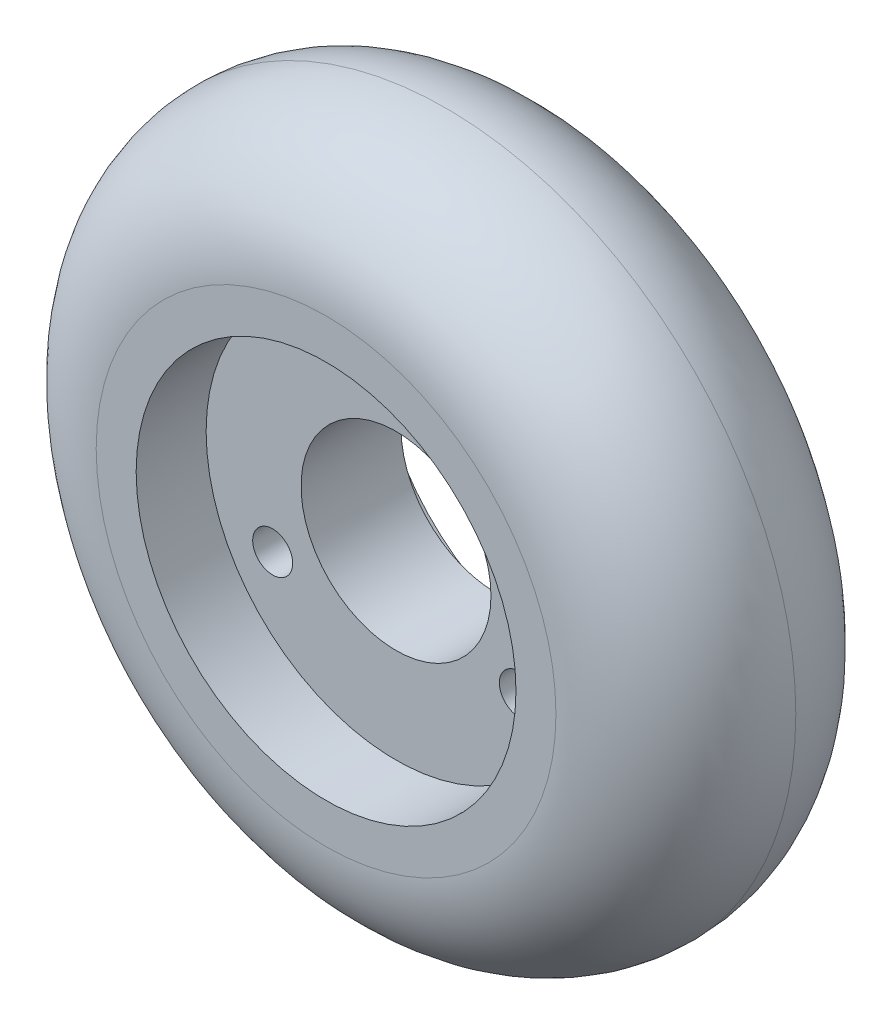
ISO-10303-21;
HEADER;
FILE_DESCRIPTION(('STEP AP214'),'2;1');
FILE_NAME('part.step','',(''),(''),'','','');
FILE_SCHEMA(('AUTOMOTIVE_DESIGN { 1 0 10303 214 1 1 1 1 }'));
ENDSEC;
DATA;
#1=APPLICATION_CONTEXT('core data for automotive mechanical design processes');
#2=APPLICATION_PROTOCOL_DEFINITION('international standard','automotive_design',2000,#1);
#3=PRODUCT_CONTEXT('',#1,'mechanical');
#4=PRODUCT('Part','Part','',(#3));
#5=PRODUCT_RELATED_PRODUCT_CATEGORY('part','',(#4));
#6=PRODUCT_DEFINITION_FORMATION('','',#4);
#7=PRODUCT_DEFINITION_CONTEXT('part definition',#1,'design');
#8=PRODUCT_DEFINITION('design','',#6,#7);
#9=PRODUCT_DEFINITION_SHAPE('','',#8);
#10=(LENGTH_UNIT() NAMED_UNIT(*) SI_UNIT(.MILLI.,.METRE.));
#11=(NAMED_UNIT(*) PLANE_ANGLE_UNIT() SI_UNIT($,.RADIAN.));
#12=(NAMED_UNIT(*) SI_UNIT($,.STERADIAN.) SOLID_ANGLE_UNIT());
#13=UNCERTAINTY_MEASURE_WITH_UNIT(LENGTH_MEASURE(1.E-05),#10,'distance_accuracy_value','');
#14=(GEOMETRIC_REPRESENTATION_CONTEXT(3) GLOBAL_UNCERTAINTY_ASSIGNED_CONTEXT((#13)) GLOBAL_UNIT_ASSIGNED_CONTEXT((#10,
#11,#12)) REPRESENTATION_CONTEXT('',''));
#15=CARTESIAN_POINT('',(0.,0.,0.));
#16=DIRECTION('',(0.,0.,1.));
#17=DIRECTION('',(1.,0.,0.));
#18=AXIS2_PLACEMENT_3D('',#15,#16,#17);
#19=CARTESIAN_POINT('',(0.,0.,24.));
#20=DIRECTION('',(0.,0.,1.));
#21=DIRECTION('',(1.,0.,0.));
#22=AXIS2_PLACEMENT_3D('',#19,#20,#21);
#23=PLANE('',#22);
#24=CARTESIAN_POINT('',(0.,0.,24.));
#25=DIRECTION('',(0.,0.,1.));
#26=DIRECTION('',(1.,0.,0.));
#27=AXIS2_PLACEMENT_3D('',#24,#25,#26);
#28=CIRCLE('',#27,19.);
#29=CARTESIAN_POINT('',(19.,0.,24.));
#30=VERTEX_POINT('',#29);
#31=EDGE_CURVE('E73',#30,#30,#28,.T.);
#32=ORIENTED_EDGE('',*,*,#31,.F.);
#33=EDGE_LOOP('',(#32));
#34=FACE_BOUND('',#33,.T.);
#35=CARTESIAN_POINT('',(0.,0.,24.));
#36=DIRECTION('',(0.,0.,1.));
#37=DIRECTION('',(1.,0.,0.));
#38=AXIS2_PLACEMENT_3D('',#35,#36,#37);
#39=CIRCLE('',#38,23.);
#40=CARTESIAN_POINT('',(23.,0.,24.));
#41=VERTEX_POINT('',#40);
#42=EDGE_CURVE('E41',#41,#41,#39,.T.);
#43=ORIENTED_EDGE('',*,*,#42,.T.);
#44=EDGE_LOOP('',(#43));
#45=FACE_BOUND('',#44,.T.);
#46=ADVANCED_FACE('F29',(#34,#45),#23,.T.);
#47=CARTESIAN_POINT('',(0.,0.,0.));
#48=DIRECTION('',(0.,0.,1.));
#49=DIRECTION('',(1.,0.,0.));
#50=AXIS2_PLACEMENT_3D('',#47,#48,#49);
#51=PLANE('',#50);
#52=CARTESIAN_POINT('',(0.,0.,0.));
#53=DIRECTION('',(0.,0.,-1.));
#54=DIRECTION('',(-1.,0.,0.));
#55=AXIS2_PLACEMENT_3D('',#52,#53,#54);
#56=CIRCLE('',#55,19.);
#57=CARTESIAN_POINT('',(-19.,0.,0.));
#58=VERTEX_POINT('',#57);
#59=EDGE_CURVE('E48',#58,#58,#56,.T.);
#60=ORIENTED_EDGE('',*,*,#59,.F.);
#61=EDGE_LOOP('',(#60));
#62=FACE_BOUND('',#61,.T.);
#63=CARTESIAN_POINT('',(0.,0.,0.));
#64=DIRECTION('',(0.,0.,1.));
#65=DIRECTION('',(1.,0.,0.));
#66=AXIS2_PLACEMENT_3D('',#63,#64,#65);
#67=CIRCLE('',#66,23.);
#68=CARTESIAN_POINT('',(23.,0.,0.));
#69=VERTEX_POINT('',#68);
#70=EDGE_CURVE('E10',#69,#69,#67,.F.);
#71=ORIENTED_EDGE('',*,*,#70,.T.);
#72=EDGE_LOOP('',(#71));
#73=FACE_BOUND('',#72,.T.);
#74=ADVANCED_FACE('F87',(#62,#73),#51,.F.);
#75=CARTESIAN_POINT('',(0.,0.,12.));
#76=DIRECTION('',(0.,0.,1.));
#77=DIRECTION('',(1.,0.,0.));
#78=AXIS2_PLACEMENT_3D('',#75,#76,#77);
#79=TOROIDAL_SURFACE('',#78,23.,12.);
#80=CARTESIAN_POINT('',(0.,0.,12.));
#81=DIRECTION('',(0.,0.,1.));
#82=DIRECTION('',(1.,0.,0.));
#83=AXIS2_PLACEMENT_3D('',#80,#81,#82);
#84=CIRCLE('',#83,35.);
#85=CARTESIAN_POINT('',(35.,0.,12.));
#86=VERTEX_POINT('',#85);
#87=EDGE_CURVE('E36',#86,#86,#84,.F.);
#88=ORIENTED_EDGE('',*,*,#87,.F.);
#89=EDGE_LOOP('',(#88));
#90=FACE_BOUND('',#89,.T.);
#91=ORIENTED_EDGE('',*,*,#42,.F.);
#92=EDGE_LOOP('',(#91));
#93=FACE_BOUND('',#92,.T.);
#94=ADVANCED_FACE('F84',(#90,#93),#79,.T.);
#95=CARTESIAN_POINT('',(0.,0.,12.));
#96=DIRECTION('',(0.,0.,1.));
#97=DIRECTION('',(1.,0.,0.));
#98=AXIS2_PLACEMENT_3D('',#95,#96,#97);
#99=TOROIDAL_SURFACE('',#98,23.,12.);
#100=ORIENTED_EDGE('',*,*,#70,.F.);
#101=EDGE_LOOP('',(#100));
#102=FACE_BOUND('',#101,.T.);
#103=ORIENTED_EDGE('',*,*,#87,.T.);
#104=EDGE_LOOP('',(#103));
#105=FACE_BOUND('',#104,.T.);
#106=ADVANCED_FACE('F86',(#102,#105),#99,.T.);
#107=CARTESIAN_POINT('',(0.,0.,17.));
#108=DIRECTION('',(0.,0.,1.));
#109=DIRECTION('',(1.,0.,0.));
#110=AXIS2_PLACEMENT_3D('',#107,#108,#109);
#111=CYLINDRICAL_SURFACE('',#110,19.);
#112=CARTESIAN_POINT('',(0.,0.,17.));
#113=DIRECTION('',(0.,0.,1.));
#114=DIRECTION('',(1.,0.,0.));
#115=AXIS2_PLACEMENT_3D('',#112,#113,#114);
#116=CIRCLE('',#115,19.);
#117=CARTESIAN_POINT('',(19.,0.,17.));
#118=VERTEX_POINT('',#117);
#119=EDGE_CURVE('E76',#118,#118,#116,.T.);
#120=ORIENTED_EDGE('',*,*,#119,.F.);
#121=EDGE_LOOP('',(#120));
#122=FACE_BOUND('',#121,.T.);
#123=ORIENTED_EDGE('',*,*,#31,.T.);
#124=EDGE_LOOP('',(#123));
#125=FACE_BOUND('',#124,.T.);
#126=ADVANCED_FACE('F94',(#122,#125),#111,.F.);
#127=CARTESIAN_POINT('',(0.,0.,17.));
#128=DIRECTION('',(0.,0.,1.));
#129=DIRECTION('',(1.,0.,0.));
#130=AXIS2_PLACEMENT_3D('',#127,#128,#129);
#131=PLANE('',#130);
#132=CARTESIAN_POINT('',(-12.340862003928,-7.12500000000015,17.));
#133=DIRECTION('',(0.,0.,1.));
#134=DIRECTION('',(1.,0.,0.));
#135=AXIS2_PLACEMENT_3D('',#132,#133,#134);
#136=CIRCLE('',#135,2.0000000000004);
#137=CARTESIAN_POINT('',(-10.3408620039276,-7.12500000000015,17.));
#138=VERTEX_POINT('',#137);
#139=EDGE_CURVE('E65',#138,#138,#136,.T.);
#140=ORIENTED_EDGE('',*,*,#139,.F.);
#141=EDGE_LOOP('',(#140));
#142=FACE_BOUND('',#141,.T.);
#143=CARTESIAN_POINT('',(12.3408620039285,-7.12499999999985,17.));
#144=DIRECTION('',(0.,0.,1.));
#145=DIRECTION('',(1.,0.,0.));
#146=AXIS2_PLACEMENT_3D('',#143,#144,#145);
#147=CIRCLE('',#146,2.0000000000004);
#148=CARTESIAN_POINT('',(14.3408620039289,-7.12499999999985,17.));
#149=VERTEX_POINT('',#148);
#150=EDGE_CURVE('E55',#149,#149,#147,.T.);
#151=ORIENTED_EDGE('',*,*,#150,.F.);
#152=EDGE_LOOP('',(#151));
#153=FACE_BOUND('',#152,.T.);
#154=CARTESIAN_POINT('',(0.,14.25,17.));
#155=DIRECTION('',(0.,0.,1.));
#156=DIRECTION('',(1.,0.,0.));
#157=AXIS2_PLACEMENT_3D('',#154,#155,#156);
#158=CIRCLE('',#157,2.0000000000004);
#159=CARTESIAN_POINT('',(2.0000000000004,14.25,17.));
#160=VERTEX_POINT('',#159);
#161=EDGE_CURVE('E52',#160,#160,#158,.T.);
#162=ORIENTED_EDGE('',*,*,#161,.F.);
#163=EDGE_LOOP('',(#162));
#164=FACE_BOUND('',#163,.T.);
#165=CARTESIAN_POINT('',(0.,0.,17.));
#166=DIRECTION('',(0.,0.,1.));
#167=DIRECTION('',(1.,0.,0.));
#168=AXIS2_PLACEMENT_3D('',#165,#166,#167);
#169=CIRCLE('',#168,9.5);
#170=CARTESIAN_POINT('',(9.5,0.,17.));
#171=VERTEX_POINT('',#170);
#172=EDGE_CURVE('E49',#171,#171,#169,.T.);
#173=ORIENTED_EDGE('',*,*,#172,.F.);
#174=EDGE_LOOP('',(#173));
#175=FACE_BOUND('',#174,.T.);
#176=ORIENTED_EDGE('',*,*,#119,.T.);
#177=EDGE_LOOP('',(#176));
#178=FACE_BOUND('',#177,.T.);
#179=ADVANCED_FACE('F106',(#142,#153,#164,#175,#178),#131,.T.);
#180=CARTESIAN_POINT('',(0.,0.,7.));
#181=DIRECTION('',(0.,0.,-1.));
#182=DIRECTION('',(-1.,0.,0.));
#183=AXIS2_PLACEMENT_3D('',#180,#181,#182);
#184=CYLINDRICAL_SURFACE('',#183,19.);
#185=CARTESIAN_POINT('',(0.,0.,7.));
#186=DIRECTION('',(0.,0.,-1.));
#187=DIRECTION('',(-1.,0.,0.));
#188=AXIS2_PLACEMENT_3D('',#185,#186,#187);
#189=CIRCLE('',#188,19.);
#190=CARTESIAN_POINT('',(-19.,0.,7.));
#191=VERTEX_POINT('',#190);
#192=EDGE_CURVE('E70',#191,#191,#189,.T.);
#193=ORIENTED_EDGE('',*,*,#192,.F.);
#194=EDGE_LOOP('',(#193));
#195=FACE_BOUND('',#194,.T.);
#196=ORIENTED_EDGE('',*,*,#59,.T.);
#197=EDGE_LOOP('',(#196));
#198=FACE_BOUND('',#197,.T.);
#199=ADVANCED_FACE('F112',(#195,#198),#184,.F.);
#200=CARTESIAN_POINT('',(0.,0.,7.));
#201=DIRECTION('',(0.,0.,-1.));
#202=DIRECTION('',(-1.,0.,0.));
#203=AXIS2_PLACEMENT_3D('',#200,#201,#202);
#204=PLANE('',#203);
#205=CARTESIAN_POINT('',(-12.340862003928,-7.12500000000015,7.));
#206=DIRECTION('',(0.,0.,-1.));
#207=DIRECTION('',(-1.,0.,0.));
#208=AXIS2_PLACEMENT_3D('',#205,#206,#207);
#209=CIRCLE('',#208,2.0000000000004);
#210=CARTESIAN_POINT('',(-14.3408620039284,-7.12500000000015,7.));
#211=VERTEX_POINT('',#210);
#212=EDGE_CURVE('E32',#211,#211,#209,.T.);
#213=ORIENTED_EDGE('',*,*,#212,.F.);
#214=EDGE_LOOP('',(#213));
#215=FACE_BOUND('',#214,.T.);
#216=CARTESIAN_POINT('',(12.3408620039285,-7.12499999999985,7.));
#217=DIRECTION('',(0.,0.,-1.));
#218=DIRECTION('',(-1.,0.,0.));
#219=AXIS2_PLACEMENT_3D('',#216,#217,#218);
#220=CIRCLE('',#219,2.0000000000004);
#221=CARTESIAN_POINT('',(10.3408620039281,-7.12499999999985,7.));
#222=VERTEX_POINT('',#221);
#223=EDGE_CURVE('E53',#222,#222,#220,.T.);
#224=ORIENTED_EDGE('',*,*,#223,.F.);
#225=EDGE_LOOP('',(#224));
#226=FACE_BOUND('',#225,.T.);
#227=CARTESIAN_POINT('',(0.,14.25,7.));
#228=DIRECTION('',(0.,0.,-1.));
#229=DIRECTION('',(-1.,0.,0.));
#230=AXIS2_PLACEMENT_3D('',#227,#228,#229);
#231=CIRCLE('',#230,2.0000000000004);
#232=CARTESIAN_POINT('',(-2.0000000000004,14.25,7.));
#233=VERTEX_POINT('',#232);
#234=EDGE_CURVE('E50',#233,#233,#231,.T.);
#235=ORIENTED_EDGE('',*,*,#234,.F.);
#236=EDGE_LOOP('',(#235));
#237=FACE_BOUND('',#236,.T.);
#238=CARTESIAN_POINT('',(0.,0.,7.));
#239=DIRECTION('',(0.,0.,-1.));
#240=DIRECTION('',(-1.,0.,0.));
#241=AXIS2_PLACEMENT_3D('',#238,#239,#240);
#242=CIRCLE('',#241,9.5);
#243=CARTESIAN_POINT('',(-9.5,0.,7.));
#244=VERTEX_POINT('',#243);
#245=EDGE_CURVE('E45',#244,#244,#242,.T.);
#246=ORIENTED_EDGE('',*,*,#245,.F.);
#247=EDGE_LOOP('',(#246));
#248=FACE_BOUND('',#247,.T.);
#249=ORIENTED_EDGE('',*,*,#192,.T.);
#250=EDGE_LOOP('',(#249));
#251=FACE_BOUND('',#250,.T.);
#252=ADVANCED_FACE('F119',(#215,#226,#237,#248,#251),#204,.T.);
#253=CARTESIAN_POINT('',(0.,0.,0.));
#254=DIRECTION('',(0.,0.,1.));
#255=DIRECTION('',(1.,0.,0.));
#256=AXIS2_PLACEMENT_3D('',#253,#254,#255);
#257=CYLINDRICAL_SURFACE('',#256,9.5);
#258=ORIENTED_EDGE('',*,*,#245,.T.);
#259=EDGE_LOOP('',(#258));
#260=FACE_BOUND('',#259,.T.);
#261=ORIENTED_EDGE('',*,*,#172,.T.);
#262=EDGE_LOOP('',(#261));
#263=FACE_BOUND('',#262,.T.);
#264=ADVANCED_FACE('F123',(#260,#263),#257,.F.);
#265=CARTESIAN_POINT('',(0.,14.25,0.));
#266=DIRECTION('',(0.,0.,1.));
#267=DIRECTION('',(1.,0.,0.));
#268=AXIS2_PLACEMENT_3D('',#265,#266,#267);
#269=CYLINDRICAL_SURFACE('',#268,2.0000000000004);
#270=ORIENTED_EDGE('',*,*,#234,.T.);
#271=EDGE_LOOP('',(#270));
#272=FACE_BOUND('',#271,.T.);
#273=ORIENTED_EDGE('',*,*,#161,.T.);
#274=EDGE_LOOP('',(#273));
#275=FACE_BOUND('',#274,.T.);
#276=ADVANCED_FACE('F127',(#272,#275),#269,.F.);
#277=CARTESIAN_POINT('',(12.3408620039285,-7.12499999999985,0.));
#278=DIRECTION('',(0.,0.,1.));
#279=DIRECTION('',(1.,0.,0.));
#280=AXIS2_PLACEMENT_3D('',#277,#278,#279);
#281=CYLINDRICAL_SURFACE('',#280,2.0000000000004);
#282=ORIENTED_EDGE('',*,*,#223,.T.);
#283=EDGE_LOOP('',(#282));
#284=FACE_BOUND('',#283,.T.);
#285=ORIENTED_EDGE('',*,*,#150,.T.);
#286=EDGE_LOOP('',(#285));
#287=FACE_BOUND('',#286,.T.);
#288=ADVANCED_FACE('F131',(#284,#287),#281,.F.);
#289=CARTESIAN_POINT('',(-12.340862003928,-7.12500000000015,0.));
#290=DIRECTION('',(0.,0.,1.));
#291=DIRECTION('',(1.,0.,0.));
#292=AXIS2_PLACEMENT_3D('',#289,#290,#291);
#293=CYLINDRICAL_SURFACE('',#292,2.0000000000004);
#294=ORIENTED_EDGE('',*,*,#212,.T.);
#295=EDGE_LOOP('',(#294));
#296=FACE_BOUND('',#295,.T.);
#297=ORIENTED_EDGE('',*,*,#139,.T.);
#298=EDGE_LOOP('',(#297));
#299=FACE_BOUND('',#298,.T.);
#300=ADVANCED_FACE('F135',(#296,#299),#293,.F.);
#301=CLOSED_SHELL('',(#46,#74,#94,#106,#126,#179,#199,#252,#264,#276,#288,#300));
#302=MANIFOLD_SOLID_BREP('B2',#301);
#303=ADVANCED_BREP_SHAPE_REPRESENTATION('',(#18,#302),#14);
#304=SHAPE_DEFINITION_REPRESENTATION(#9,#303);
ENDSEC;
END-ISO-10303-21;
